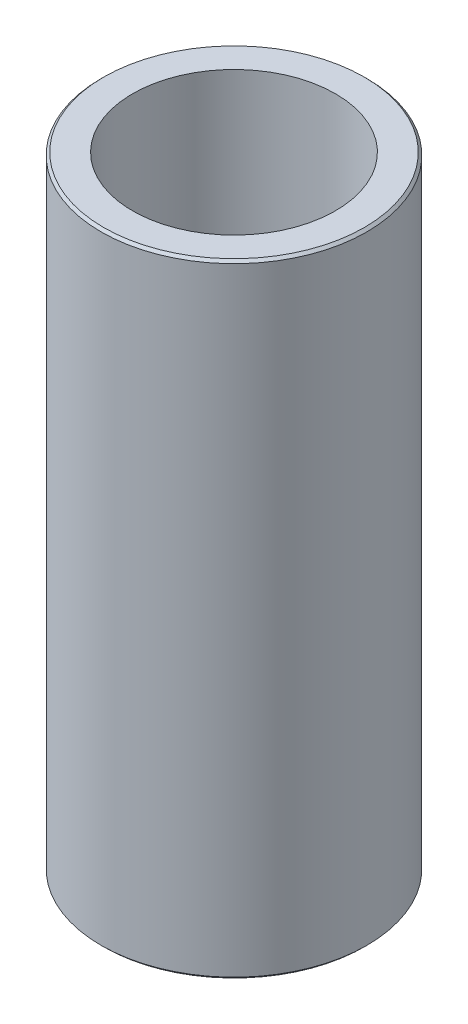
ISO-10303-21;
HEADER;
FILE_DESCRIPTION(('STEP AP214'),'2;1');
FILE_NAME('part.step','',(''),(''),'','','');
FILE_SCHEMA(('AUTOMOTIVE_DESIGN { 1 0 10303 214 1 1 1 1 }'));
ENDSEC;
DATA;
#1=APPLICATION_CONTEXT('core data for automotive mechanical design processes');
#2=APPLICATION_PROTOCOL_DEFINITION('international standard','automotive_design',2000,#1);
#3=PRODUCT_CONTEXT('',#1,'mechanical');
#4=PRODUCT('Part','Part','',(#3));
#5=PRODUCT_RELATED_PRODUCT_CATEGORY('part','',(#4));
#6=PRODUCT_DEFINITION_FORMATION('','',#4);
#7=PRODUCT_DEFINITION_CONTEXT('part definition',#1,'design');
#8=PRODUCT_DEFINITION('design','',#6,#7);
#9=PRODUCT_DEFINITION_SHAPE('','',#8);
#10=(LENGTH_UNIT() NAMED_UNIT(*) SI_UNIT(.MILLI.,.METRE.));
#11=(NAMED_UNIT(*) PLANE_ANGLE_UNIT() SI_UNIT($,.RADIAN.));
#12=(NAMED_UNIT(*) SI_UNIT($,.STERADIAN.) SOLID_ANGLE_UNIT());
#13=UNCERTAINTY_MEASURE_WITH_UNIT(LENGTH_MEASURE(1.E-05),#10,'distance_accuracy_value','');
#14=(GEOMETRIC_REPRESENTATION_CONTEXT(3) GLOBAL_UNCERTAINTY_ASSIGNED_CONTEXT((#13)) GLOBAL_UNIT_ASSIGNED_CONTEXT((#10,
#11,#12)) REPRESENTATION_CONTEXT('',''));
#15=CARTESIAN_POINT('',(0.,0.,0.));
#16=DIRECTION('',(0.,0.,1.));
#17=DIRECTION('',(1.,0.,0.));
#18=AXIS2_PLACEMENT_3D('',#15,#16,#17);
#19=CARTESIAN_POINT('',(0.,117.230472298871,0.));
#20=DIRECTION('',(0.,-1.,0.));
#21=DIRECTION('',(0.,0.,-1.));
#22=AXIS2_PLACEMENT_3D('',#19,#20,#21);
#23=CYLINDRICAL_SURFACE('',#22,25.);
#24=CARTESIAN_POINT('',(0.,116.752052636653,0.));
#25=DIRECTION('',(0.,1.,0.));
#26=DIRECTION('',(0.,0.,1.));
#27=AXIS2_PLACEMENT_3D('',#24,#25,#26);
#28=CIRCLE('',#27,25.);
#29=CARTESIAN_POINT('',(0.,116.752052636653,-25.));
#30=VERTEX_POINT('',#29);
#31=EDGE_CURVE('E50',#30,#30,#28,.F.);
#32=CARTESIAN_POINT('',(0.,0.478419662218177,0.));
#33=DIRECTION('',(0.,1.,0.));
#34=DIRECTION('',(0.,0.,1.));
#35=AXIS2_PLACEMENT_3D('',#32,#33,#34);
#36=CIRCLE('',#35,25.);
#37=CARTESIAN_POINT('',(0.,0.478419662218177,-25.));
#38=VERTEX_POINT('',#37);
#39=EDGE_CURVE('E51',#38,#38,#36,.T.);
#40=CARTESIAN_POINT('',(0.,116.752052636653,-25.));
#41=CARTESIAN_POINT('',(0.,115.540868959836,-25.));
#42=CARTESIAN_POINT('',(0.,114.329685283019,-25.));
#43=CARTESIAN_POINT('',(0.,111.907317929385,-25.));
#44=CARTESIAN_POINT('',(0.,110.696134252568,-25.));
#45=CARTESIAN_POINT('',(0.,108.273766898934,-25.));
#46=CARTESIAN_POINT('',(0.,107.062583222117,-25.));
#47=CARTESIAN_POINT('',(0.,104.640215868483,-25.));
#48=CARTESIAN_POINT('',(0.,103.429032191666,-25.));
#49=CARTESIAN_POINT('',(0.,101.006664838032,-25.));
#50=CARTESIAN_POINT('',(0.,99.7954811612148,-25.));
#51=CARTESIAN_POINT('',(0.,97.3731138075807,-25.));
#52=CARTESIAN_POINT('',(0.,96.1619301307637,-25.));
#53=CARTESIAN_POINT('',(0.,93.7395627771296,-25.));
#54=CARTESIAN_POINT('',(0.,92.5283791003126,-25.));
#55=CARTESIAN_POINT('',(0.,90.1060117466785,-25.));
#56=CARTESIAN_POINT('',(0.,88.8948280698615,-25.));
#57=CARTESIAN_POINT('',(0.,86.4724607162274,-25.));
#58=CARTESIAN_POINT('',(0.,85.2612770394104,-25.));
#59=CARTESIAN_POINT('',(0.,82.8389096857763,-25.));
#60=CARTESIAN_POINT('',(0.,81.6277260089593,-25.));
#61=CARTESIAN_POINT('',(0.,79.2053586553252,-25.));
#62=CARTESIAN_POINT('',(0.,77.9941749785082,-25.));
#63=CARTESIAN_POINT('',(0.,75.5718076248741,-25.));
#64=CARTESIAN_POINT('',(0.,74.3606239480571,-25.));
#65=CARTESIAN_POINT('',(0.,71.9382565944231,-25.));
#66=CARTESIAN_POINT('',(0.,70.727072917606,-25.));
#67=CARTESIAN_POINT('',(0.,68.304705563972,-25.));
#68=CARTESIAN_POINT('',(0.,67.0935218871549,-25.));
#69=CARTESIAN_POINT('',(0.,64.6711545335209,-25.));
#70=CARTESIAN_POINT('',(0.,63.4599708567038,-25.));
#71=CARTESIAN_POINT('',(0.,61.0376035030698,-25.));
#72=CARTESIAN_POINT('',(0.,59.8264198262527,-25.));
#73=CARTESIAN_POINT('',(0.,57.4040524726187,-25.));
#74=CARTESIAN_POINT('',(0.,56.1928687958016,-25.));
#75=CARTESIAN_POINT('',(0.,53.7705014421676,-25.));
#76=CARTESIAN_POINT('',(0.,52.5593177653505,-25.));
#77=CARTESIAN_POINT('',(0.,50.1369504117165,-25.));
#78=CARTESIAN_POINT('',(0.,48.9257667348995,-25.));
#79=CARTESIAN_POINT('',(0.,46.5033993812654,-25.));
#80=CARTESIAN_POINT('',(0.,45.2922157044484,-25.));
#81=CARTESIAN_POINT('',(0.,42.8698483508143,-25.));
#82=CARTESIAN_POINT('',(0.,41.6586646739973,-25.));
#83=CARTESIAN_POINT('',(0.,39.2362973203632,-25.));
#84=CARTESIAN_POINT('',(0.,38.0251136435462,-25.));
#85=CARTESIAN_POINT('',(0.,35.6027462899121,-25.));
#86=CARTESIAN_POINT('',(0.,34.3915626130951,-25.));
#87=CARTESIAN_POINT('',(0.,31.969195259461,-25.));
#88=CARTESIAN_POINT('',(0.,30.758011582644,-25.));
#89=CARTESIAN_POINT('',(0.,28.3356442290099,-25.));
#90=CARTESIAN_POINT('',(0.,27.1244605521929,-25.));
#91=CARTESIAN_POINT('',(0.,24.7020931985588,-25.));
#92=CARTESIAN_POINT('',(0.,23.4909095217418,-25.));
#93=CARTESIAN_POINT('',(0.,21.0685421681077,-25.));
#94=CARTESIAN_POINT('',(0.,19.8573584912907,-25.));
#95=CARTESIAN_POINT('',(0.,17.4349911376566,-25.));
#96=CARTESIAN_POINT('',(0.,16.2238074608396,-25.));
#97=CARTESIAN_POINT('',(0.,13.8014401072055,-25.));
#98=CARTESIAN_POINT('',(0.,12.5902564303885,-25.));
#99=CARTESIAN_POINT('',(0.,10.1678890767544,-25.));
#100=CARTESIAN_POINT('',(0.,8.9567053999374,-25.));
#101=CARTESIAN_POINT('',(0.,6.53433804630334,-25.));
#102=CARTESIAN_POINT('',(0.,5.32315436948631,-25.));
#103=CARTESIAN_POINT('',(0.,2.90078701585224,-25.));
#104=CARTESIAN_POINT('',(0.,1.68960333903521,-25.));
#105=CARTESIAN_POINT('',(0.,0.478419662218177,-25.));
#106=B_SPLINE_CURVE_WITH_KNOTS('',3,(#40,#41,#42,#43,#44,#45,#46,#47,#48,#49,#50,#51,#52,#53,
#54,#55,#56,#57,#58,#59,#60,#61,#62,#63,#64,#65,#66,#67,#68,#69,#70,#71,#72,#73,#74,#75,#76,#77,
#78,#79,#80,#81,#82,#83,#84,#85,#86,#87,#88,#89,#90,#91,#92,#93,#94,#95,#96,#97,#98,#99,#100,
#101,#102,#103,#104,#105),.UNSPECIFIED.,.F.,.F.,(4,2,2,2,2,2,2,2,2,2,2,2,2,2,2,2,2,2,2,2,2,2,2,
2,2,2,2,2,2,2,2,2,4),(0.,3.6335510304511,7.2671020609022,10.9006530913533,14.5342041218044,
18.1677551522555,21.8013061827066,25.4348572131577,29.0684082436088,32.7019592740599,
36.335510304511,39.9690613349621,43.6026123654132,47.2361633958642,50.8697144263153,
54.5032654567664,58.1368164872175,61.7703675176686,65.4039185481197,69.0374695785708,
72.6710206090219,76.304571639473,79.9381226699241,83.5716737003752,87.2052247308263,
90.8387757612774,94.4723267917285,98.1058778221796,101.739428852631,105.372979883082,
109.006530913533,112.640081943984,116.273632974435),.UNSPECIFIED.);
#107=EDGE_CURVE('BSEAM39',#30,#38,#106,.T.);
#108=ORIENTED_EDGE('',*,*,#31,.T.);
#109=ORIENTED_EDGE('',*,*,#39,.T.);
#110=ORIENTED_EDGE('',*,*,#107,.T.);
#111=ORIENTED_EDGE('',*,*,#107,.F.);
#112=EDGE_LOOP('',(#108,#110,#109,#111));
#113=FACE_BOUND('',#112,.T.);
#114=ADVANCED_FACE('F39',(#113),#23,.T.);
#115=CARTESIAN_POINT('',(0.,117.230472298871,0.));
#116=DIRECTION('',(0.,1.,0.));
#117=DIRECTION('',(0.,0.,1.));
#118=AXIS2_PLACEMENT_3D('',#115,#116,#117);
#119=PLANE('',#118);
#120=CARTESIAN_POINT('',(0.,117.230472298871,0.));
#121=DIRECTION('',(0.,1.,0.));
#122=DIRECTION('',(0.,0.,1.));
#123=AXIS2_PLACEMENT_3D('',#120,#121,#122);
#124=CIRCLE('',#123,24.521580337782);
#125=CARTESIAN_POINT('',(0.,117.230472298871,24.521580337782));
#126=VERTEX_POINT('',#125);
#127=EDGE_CURVE('E54',#126,#126,#124,.T.);
#128=ORIENTED_EDGE('',*,*,#127,.T.);
#129=EDGE_LOOP('',(#128));
#130=FACE_BOUND('',#129,.T.);
#131=CARTESIAN_POINT('',(0.,117.230472298871,0.));
#132=DIRECTION('',(0.,1.,0.));
#133=DIRECTION('',(0.,0.,1.));
#134=AXIS2_PLACEMENT_3D('',#131,#132,#133);
#135=CIRCLE('',#134,19.0898069816249);
#136=CARTESIAN_POINT('',(0.,117.230472298871,-19.0898069816249));
#137=VERTEX_POINT('',#136);
#138=EDGE_CURVE('E58',#137,#137,#135,.T.);
#139=ORIENTED_EDGE('',*,*,#138,.F.);
#140=EDGE_LOOP('',(#139));
#141=FACE_BOUND('',#140,.T.);
#142=ADVANCED_FACE('F69',(#130,#141),#119,.T.);
#143=CARTESIAN_POINT('',(0.,0.,0.));
#144=DIRECTION('',(0.,1.,0.));
#145=DIRECTION('',(0.,0.,1.));
#146=AXIS2_PLACEMENT_3D('',#143,#144,#145);
#147=PLANE('',#146);
#148=CARTESIAN_POINT('',(0.,0.,0.));
#149=DIRECTION('',(0.,1.,0.));
#150=DIRECTION('',(0.,0.,1.));
#151=AXIS2_PLACEMENT_3D('',#148,#149,#150);
#152=CIRCLE('',#151,24.5215803377818);
#153=CARTESIAN_POINT('',(0.,0.,24.5215803377818));
#154=VERTEX_POINT('',#153);
#155=EDGE_CURVE('E10',#154,#154,#152,.F.);
#156=ORIENTED_EDGE('',*,*,#155,.T.);
#157=EDGE_LOOP('',(#156));
#158=FACE_BOUND('',#157,.T.);
#159=CARTESIAN_POINT('',(0.,0.,0.));
#160=DIRECTION('',(0.,1.,0.));
#161=DIRECTION('',(0.,0.,1.));
#162=AXIS2_PLACEMENT_3D('',#159,#160,#161);
#163=CIRCLE('',#162,19.0898069816249);
#164=CARTESIAN_POINT('',(0.,0.,-19.0898069816249));
#165=VERTEX_POINT('',#164);
#166=EDGE_CURVE('E63',#165,#165,#163,.T.);
#167=ORIENTED_EDGE('',*,*,#166,.T.);
#168=EDGE_LOOP('',(#167));
#169=FACE_BOUND('',#168,.T.);
#170=ADVANCED_FACE('F75',(#158,#169),#147,.F.);
#171=CARTESIAN_POINT('',(0.,117.230472298871,0.));
#172=DIRECTION('',(0.,-1.,0.));
#173=DIRECTION('',(0.,0.,-1.));
#174=AXIS2_PLACEMENT_3D('',#171,#172,#173);
#175=CYLINDRICAL_SURFACE('',#174,19.0898069816249);
#176=CARTESIAN_POINT('',(0.,117.230472298871,-19.0898069816249));
#177=CARTESIAN_POINT('',(0.,116.009321545758,-19.0898069816249));
#178=CARTESIAN_POINT('',(0.,114.788170792645,-19.0898069816249));
#179=CARTESIAN_POINT('',(0.,112.345869286418,-19.0898069816249));
#180=CARTESIAN_POINT('',(0.,111.124718533305,-19.0898069816249));
#181=CARTESIAN_POINT('',(0.,108.682417027079,-19.0898069816249));
#182=CARTESIAN_POINT('',(0.,107.461266273965,-19.0898069816249));
#183=CARTESIAN_POINT('',(0.,105.018964767739,-19.0898069816249));
#184=CARTESIAN_POINT('',(0.,103.797814014626,-19.0898069816249));
#185=CARTESIAN_POINT('',(0.,101.355512508399,-19.0898069816249));
#186=CARTESIAN_POINT('',(0.,100.134361755286,-19.0898069816249));
#187=CARTESIAN_POINT('',(0.,97.6920602490594,-19.0898069816249));
#188=CARTESIAN_POINT('',(0.,96.4709094959461,-19.0898069816249));
#189=CARTESIAN_POINT('',(0.,94.0286079897196,-19.0898069816249));
#190=CARTESIAN_POINT('',(0.,92.8074572366064,-19.0898069816249));
#191=CARTESIAN_POINT('',(0.,90.3651557303799,-19.0898069816249));
#192=CARTESIAN_POINT('',(0.,89.1440049772667,-19.0898069816249));
#193=CARTESIAN_POINT('',(0.,86.7017034710402,-19.0898069816249));
#194=CARTESIAN_POINT('',(0.,85.480552717927,-19.0898069816249));
#195=CARTESIAN_POINT('',(0.,83.0382512117005,-19.0898069816249));
#196=CARTESIAN_POINT('',(0.,81.8171004585872,-19.0898069816249));
#197=CARTESIAN_POINT('',(0.,79.3747989523607,-19.0898069816249));
#198=CARTESIAN_POINT('',(0.,78.1536481992475,-19.0898069816249));
#199=CARTESIAN_POINT('',(0.,75.711346693021,-19.0898069816249));
#200=CARTESIAN_POINT('',(0.,74.4901959399078,-19.0898069816249));
#201=CARTESIAN_POINT('',(0.,72.0478944336813,-19.0898069816249));
#202=CARTESIAN_POINT('',(0.,70.826743680568,-19.0898069816249));
#203=CARTESIAN_POINT('',(0.,68.3844421743416,-19.0898069816249));
#204=CARTESIAN_POINT('',(0.,67.1632914212283,-19.0898069816249));
#205=CARTESIAN_POINT('',(0.,64.7209899150018,-19.0898069816249));
#206=CARTESIAN_POINT('',(0.,63.4998391618886,-19.0898069816249));
#207=CARTESIAN_POINT('',(0.,61.0575376556621,-19.0898069816249));
#208=CARTESIAN_POINT('',(0.,59.8363869025489,-19.0898069816249));
#209=CARTESIAN_POINT('',(0.,57.3940853963224,-19.0898069816249));
#210=CARTESIAN_POINT('',(0.,56.1729346432091,-19.0898069816249));
#211=CARTESIAN_POINT('',(0.,53.7306331369827,-19.0898069816249));
#212=CARTESIAN_POINT('',(0.,52.5094823838694,-19.0898069816249));
#213=CARTESIAN_POINT('',(0.,50.0671808776429,-19.0898069816249));
#214=CARTESIAN_POINT('',(0.,48.8460301245297,-19.0898069816249));
#215=CARTESIAN_POINT('',(0.,46.4037286183032,-19.0898069816249));
#216=CARTESIAN_POINT('',(0.,45.18257786519,-19.0898069816249));
#217=CARTESIAN_POINT('',(0.,42.7402763589635,-19.0898069816249));
#218=CARTESIAN_POINT('',(0.,41.5191256058502,-19.0898069816249));
#219=CARTESIAN_POINT('',(0.,39.0768240996237,-19.0898069816249));
#220=CARTESIAN_POINT('',(0.,37.8556733465105,-19.0898069816249));
#221=CARTESIAN_POINT('',(0.,35.413371840284,-19.0898069816249));
#222=CARTESIAN_POINT('',(0.,34.1922210871708,-19.0898069816249));
#223=CARTESIAN_POINT('',(0.,31.7499195809443,-19.0898069816249));
#224=CARTESIAN_POINT('',(0.,30.5287688278311,-19.0898069816249));
#225=CARTESIAN_POINT('',(0.,28.0864673216046,-19.0898069816249));
#226=CARTESIAN_POINT('',(0.,26.8653165684913,-19.0898069816249));
#227=CARTESIAN_POINT('',(0.,24.4230150622648,-19.0898069816249));
#228=CARTESIAN_POINT('',(0.,23.2018643091516,-19.0898069816249));
#229=CARTESIAN_POINT('',(0.,20.7595628029251,-19.0898069816249));
#230=CARTESIAN_POINT('',(0.,19.5384120498119,-19.0898069816249));
#231=CARTESIAN_POINT('',(0.,17.0961105435854,-19.0898069816249));
#232=CARTESIAN_POINT('',(0.,15.8749597904722,-19.0898069816249));
#233=CARTESIAN_POINT('',(0.,13.4326582842457,-19.0898069816249));
#234=CARTESIAN_POINT('',(0.,12.2115075311324,-19.0898069816249));
#235=CARTESIAN_POINT('',(0.,9.76920602490594,-19.0898069816249));
#236=CARTESIAN_POINT('',(0.,8.5480552717927,-19.0898069816249));
#237=CARTESIAN_POINT('',(0.,6.10575376556621,-19.0898069816249));
#238=CARTESIAN_POINT('',(0.,4.88460301245297,-19.0898069816249));
#239=CARTESIAN_POINT('',(0.,2.44230150622648,-19.0898069816249));
#240=CARTESIAN_POINT('',(0.,1.22115075311324,-19.0898069816249));
#241=CARTESIAN_POINT('',(0.,0.,-19.0898069816249));
#242=B_SPLINE_CURVE_WITH_KNOTS('',3,(#176,#177,#178,#179,#180,#181,#182,#183,#184,#185,#186,
#187,#188,#189,#190,#191,#192,#193,#194,#195,#196,#197,#198,#199,#200,#201,#202,#203,#204,#205,
#206,#207,#208,#209,#210,#211,#212,#213,#214,#215,#216,#217,#218,#219,#220,#221,#222,#223,#224,
#225,#226,#227,#228,#229,#230,#231,#232,#233,#234,#235,#236,#237,#238,#239,#240,#241),
.UNSPECIFIED.,.F.,.F.,(4,2,2,2,2,2,2,2,2,2,2,2,2,2,2,2,2,2,2,2,2,2,2,2,2,2,2,2,2,2,2,2,4),(0.,
3.66345225933971,7.32690451867944,10.9903567780192,14.6538090373589,18.3172612966986,
21.9807135560384,25.6441658153781,29.3076180747178,32.9710703340575,36.6345225933973,
40.297974852737,43.9614271120767,47.6248793714164,51.2883316307562,54.9517838900959,
58.6152361494356,62.2786884087753,65.9421406681151,69.6055929274548,73.2690451867945,
76.9324974461342,80.595949705474,84.2594019648137,87.9228542241534,91.5863064834932,
95.2497587428329,98.9132110021726,102.576663261512,106.240115520852,109.903567780192,
113.567020039532,117.230472298871),.UNSPECIFIED.);
#243=EDGE_CURVE('BSEAM70',#137,#165,#242,.T.);
#244=ORIENTED_EDGE('',*,*,#138,.T.);
#245=ORIENTED_EDGE('',*,*,#166,.F.);
#246=ORIENTED_EDGE('',*,*,#243,.T.);
#247=ORIENTED_EDGE('',*,*,#243,.F.);
#248=EDGE_LOOP('',(#244,#246,#245,#247));
#249=FACE_BOUND('',#248,.T.);
#250=ADVANCED_FACE('F70',(#249),#175,.F.);
#251=CARTESIAN_POINT('',(0.,117.230472298871,0.));
#252=DIRECTION('',(0.,-1.,0.));
#253=DIRECTION('',(0.,0.,-1.));
#254=AXIS2_PLACEMENT_3D('',#251,#252,#253);
#255=CONICAL_SURFACE('',#254,24.521580337782,0.785398163397445);
#256=ORIENTED_EDGE('',*,*,#31,.F.);
#257=EDGE_LOOP('',(#256));
#258=FACE_BOUND('',#257,.T.);
#259=ORIENTED_EDGE('',*,*,#127,.F.);
#260=EDGE_LOOP('',(#259));
#261=FACE_BOUND('',#260,.T.);
#262=ADVANCED_FACE('F81',(#258,#261),#255,.T.);
#263=CARTESIAN_POINT('',(0.,0.478419662218177,0.));
#264=DIRECTION('',(0.,1.,0.));
#265=DIRECTION('',(0.,0.,1.));
#266=AXIS2_PLACEMENT_3D('',#263,#264,#265);
#267=CONICAL_SURFACE('',#266,25.,0.785398163397459);
#268=ORIENTED_EDGE('',*,*,#155,.F.);
#269=EDGE_LOOP('',(#268));
#270=FACE_BOUND('',#269,.T.);
#271=ORIENTED_EDGE('',*,*,#39,.F.);
#272=EDGE_LOOP('',(#271));
#273=FACE_BOUND('',#272,.T.);
#274=ADVANCED_FACE('F45',(#270,#273),#267,.T.);
#275=CLOSED_SHELL('',(#114,#142,#170,#250,#262,#274));
#276=MANIFOLD_SOLID_BREP('B2',#275);
#277=ADVANCED_BREP_SHAPE_REPRESENTATION('',(#18,#276),#14);
#278=SHAPE_DEFINITION_REPRESENTATION(#9,#277);
ENDSEC;
END-ISO-10303-21;
